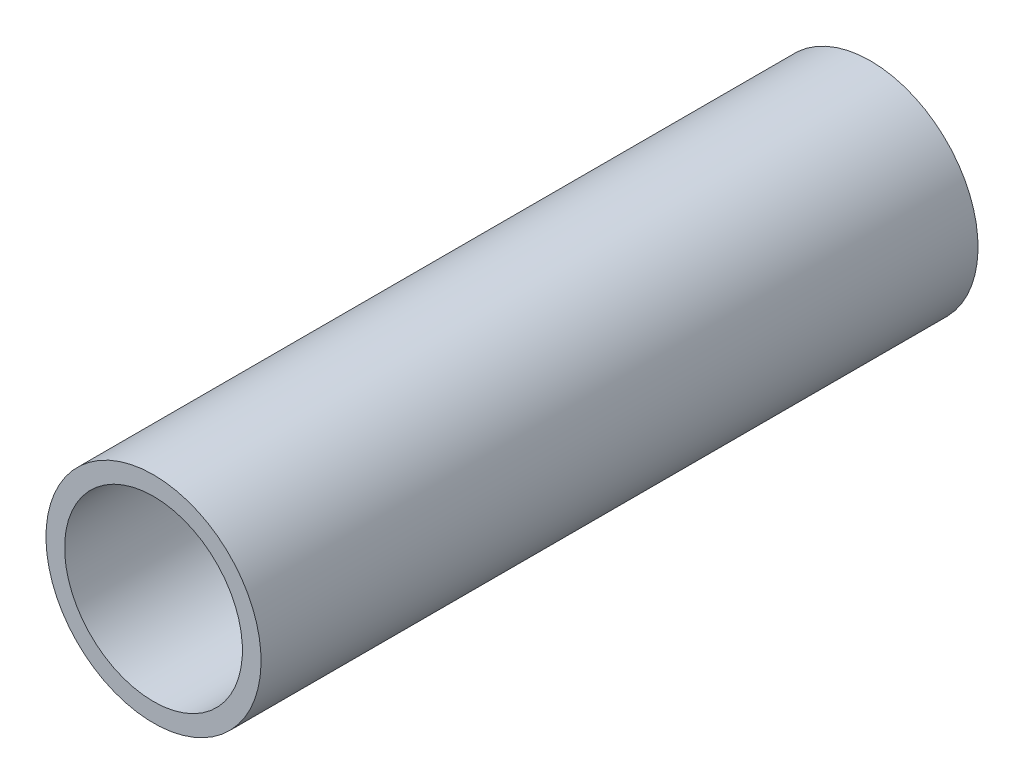
ISO-10303-21;
HEADER;
FILE_DESCRIPTION(('STEP AP214'),'2;1');
FILE_NAME('part.step','',(''),(''),'','','');
FILE_SCHEMA(('AUTOMOTIVE_DESIGN { 1 0 10303 214 1 1 1 1 }'));
ENDSEC;
DATA;
#1=APPLICATION_CONTEXT('core data for automotive mechanical design processes');
#2=APPLICATION_PROTOCOL_DEFINITION('international standard','automotive_design',2000,#1);
#3=PRODUCT_CONTEXT('',#1,'mechanical');
#4=PRODUCT('Part','Part','',(#3));
#5=PRODUCT_RELATED_PRODUCT_CATEGORY('part','',(#4));
#6=PRODUCT_DEFINITION_FORMATION('','',#4);
#7=PRODUCT_DEFINITION_CONTEXT('part definition',#1,'design');
#8=PRODUCT_DEFINITION('design','',#6,#7);
#9=PRODUCT_DEFINITION_SHAPE('','',#8);
#10=(LENGTH_UNIT() NAMED_UNIT(*) SI_UNIT(.MILLI.,.METRE.));
#11=(NAMED_UNIT(*) PLANE_ANGLE_UNIT() SI_UNIT($,.RADIAN.));
#12=(NAMED_UNIT(*) SI_UNIT($,.STERADIAN.) SOLID_ANGLE_UNIT());
#13=UNCERTAINTY_MEASURE_WITH_UNIT(LENGTH_MEASURE(1.E-05),#10,'distance_accuracy_value','');
#14=(GEOMETRIC_REPRESENTATION_CONTEXT(3) GLOBAL_UNCERTAINTY_ASSIGNED_CONTEXT((#13)) GLOBAL_UNIT_ASSIGNED_CONTEXT((#10,
#11,#12)) REPRESENTATION_CONTEXT('',''));
#15=CARTESIAN_POINT('',(0.,0.,0.));
#16=DIRECTION('',(0.,0.,1.));
#17=DIRECTION('',(1.,0.,0.));
#18=AXIS2_PLACEMENT_3D('',#15,#16,#17);
#19=CARTESIAN_POINT('',(0.,9.525,31.75));
#20=DIRECTION('',(0.,0.,1.));
#21=DIRECTION('',(0.,-1.,0.));
#22=AXIS2_PLACEMENT_3D('',#19,#20,#21);
#23=PLANE('',#22);
#24=CARTESIAN_POINT('',(0.,0.,31.75));
#25=DIRECTION('',(0.,0.,-1.));
#26=DIRECTION('',(0.,1.,0.));
#27=AXIS2_PLACEMENT_3D('',#24,#25,#26);
#28=CIRCLE('',#27,7.874);
#29=CARTESIAN_POINT('',(0.,7.874,31.75));
#30=VERTEX_POINT('',#29);
#31=EDGE_CURVE('E10',#30,#30,#28,.T.);
#32=ORIENTED_EDGE('',*,*,#31,.T.);
#33=EDGE_LOOP('',(#32));
#34=FACE_BOUND('',#33,.T.);
#35=CARTESIAN_POINT('',(0.,0.,31.75));
#36=DIRECTION('',(0.,0.,-1.));
#37=DIRECTION('',(0.,1.,0.));
#38=AXIS2_PLACEMENT_3D('',#35,#36,#37);
#39=CIRCLE('',#38,9.525);
#40=CARTESIAN_POINT('',(0.,9.525,31.75));
#41=VERTEX_POINT('',#40);
#42=EDGE_CURVE('E44',#41,#41,#39,.T.);
#43=ORIENTED_EDGE('',*,*,#42,.F.);
#44=EDGE_LOOP('',(#43));
#45=FACE_BOUND('',#44,.T.);
#46=ADVANCED_FACE('F30',(#34,#45),#23,.T.);
#47=CARTESIAN_POINT('',(0.,0.,0.));
#48=DIRECTION('',(0.,0.,-1.));
#49=DIRECTION('',(0.,1.,0.));
#50=AXIS2_PLACEMENT_3D('',#47,#48,#49);
#51=CYLINDRICAL_SURFACE('',#50,7.874);
#52=CARTESIAN_POINT('',(0.,0.,-31.75));
#53=DIRECTION('',(0.,0.,-1.));
#54=DIRECTION('',(0.,1.,0.));
#55=AXIS2_PLACEMENT_3D('',#52,#53,#54);
#56=CIRCLE('',#55,7.87399999999999);
#57=CARTESIAN_POINT('',(0.,7.874,-31.75));
#58=VERTEX_POINT('',#57);
#59=EDGE_CURVE('E36',#58,#58,#56,.T.);
#60=ORIENTED_EDGE('',*,*,#59,.T.);
#61=EDGE_LOOP('',(#60));
#62=FACE_BOUND('',#61,.T.);
#63=ORIENTED_EDGE('',*,*,#31,.F.);
#64=EDGE_LOOP('',(#63));
#65=FACE_BOUND('',#64,.T.);
#66=ADVANCED_FACE('F54',(#62,#65),#51,.F.);
#67=CARTESIAN_POINT('',(0.,7.874,-31.75));
#68=DIRECTION('',(0.,0.,-1.));
#69=DIRECTION('',(0.,1.,0.));
#70=AXIS2_PLACEMENT_3D('',#67,#68,#69);
#71=PLANE('',#70);
#72=CARTESIAN_POINT('',(0.,0.,-31.75));
#73=DIRECTION('',(0.,0.,-1.));
#74=DIRECTION('',(0.,1.,0.));
#75=AXIS2_PLACEMENT_3D('',#72,#73,#74);
#76=CIRCLE('',#75,9.52499999999999);
#77=CARTESIAN_POINT('',(0.,9.525,-31.75));
#78=VERTEX_POINT('',#77);
#79=EDGE_CURVE('E40',#78,#78,#76,.T.);
#80=ORIENTED_EDGE('',*,*,#79,.T.);
#81=EDGE_LOOP('',(#80));
#82=FACE_BOUND('',#81,.T.);
#83=ORIENTED_EDGE('',*,*,#59,.F.);
#84=EDGE_LOOP('',(#83));
#85=FACE_BOUND('',#84,.T.);
#86=ADVANCED_FACE('F58',(#82,#85),#71,.T.);
#87=CARTESIAN_POINT('',(0.,0.,0.));
#88=DIRECTION('',(0.,0.,-1.));
#89=DIRECTION('',(0.,1.,0.));
#90=AXIS2_PLACEMENT_3D('',#87,#88,#89);
#91=CYLINDRICAL_SURFACE('',#90,9.525);
#92=ORIENTED_EDGE('',*,*,#42,.T.);
#93=EDGE_LOOP('',(#92));
#94=FACE_BOUND('',#93,.T.);
#95=ORIENTED_EDGE('',*,*,#79,.F.);
#96=EDGE_LOOP('',(#95));
#97=FACE_BOUND('',#96,.T.);
#98=ADVANCED_FACE('F50',(#94,#97),#91,.T.);
#99=CLOSED_SHELL('',(#46,#66,#86,#98));
#100=MANIFOLD_SOLID_BREP('B2',#99);
#101=ADVANCED_BREP_SHAPE_REPRESENTATION('',(#18,#100),#14);
#102=SHAPE_DEFINITION_REPRESENTATION(#9,#101);
ENDSEC;
END-ISO-10303-21;
